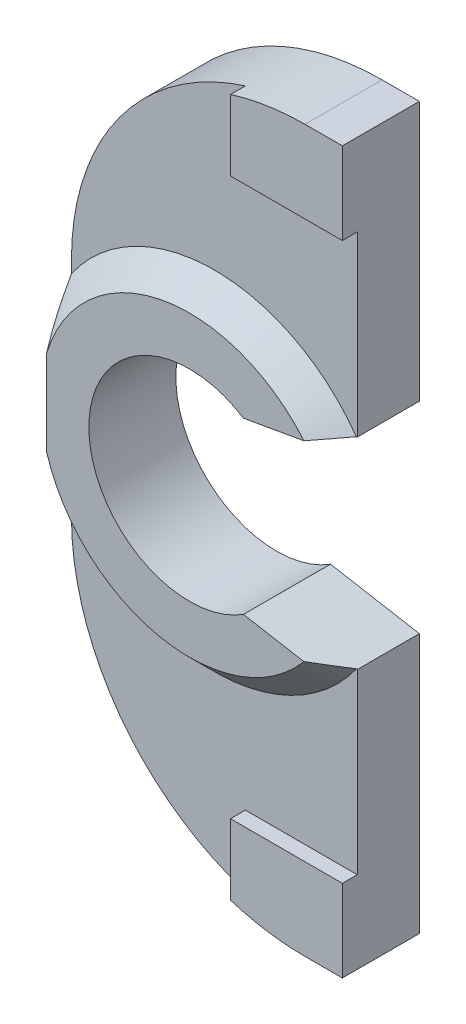
ISO-10303-21;
HEADER;
FILE_DESCRIPTION(('STEP AP214'),'2;1');
FILE_NAME('part.step','',(''),(''),'','','');
FILE_SCHEMA(('AUTOMOTIVE_DESIGN { 1 0 10303 214 1 1 1 1 }'));
ENDSEC;
DATA;
#1=APPLICATION_CONTEXT('core data for automotive mechanical design processes');
#2=APPLICATION_PROTOCOL_DEFINITION('international standard','automotive_design',2000,#1);
#3=PRODUCT_CONTEXT('',#1,'mechanical');
#4=PRODUCT('Part','Part','',(#3));
#5=PRODUCT_RELATED_PRODUCT_CATEGORY('part','',(#4));
#6=PRODUCT_DEFINITION_FORMATION('','',#4);
#7=PRODUCT_DEFINITION_CONTEXT('part definition',#1,'design');
#8=PRODUCT_DEFINITION('design','',#6,#7);
#9=PRODUCT_DEFINITION_SHAPE('','',#8);
#10=(LENGTH_UNIT() NAMED_UNIT(*) SI_UNIT(.MILLI.,.METRE.));
#11=(NAMED_UNIT(*) PLANE_ANGLE_UNIT() SI_UNIT($,.RADIAN.));
#12=(NAMED_UNIT(*) SI_UNIT($,.STERADIAN.) SOLID_ANGLE_UNIT());
#13=UNCERTAINTY_MEASURE_WITH_UNIT(LENGTH_MEASURE(1.E-05),#10,'distance_accuracy_value','');
#14=(GEOMETRIC_REPRESENTATION_CONTEXT(3) GLOBAL_UNCERTAINTY_ASSIGNED_CONTEXT((#13)) GLOBAL_UNIT_ASSIGNED_CONTEXT((#10,
#11,#12)) REPRESENTATION_CONTEXT('',''));
#15=CARTESIAN_POINT('',(0.,0.,0.));
#16=DIRECTION('',(0.,0.,1.));
#17=DIRECTION('',(1.,0.,0.));
#18=AXIS2_PLACEMENT_3D('',#15,#16,#17);
#19=CARTESIAN_POINT('',(0.,0.,2.5));
#20=DIRECTION('',(0.,0.,1.));
#21=DIRECTION('',(1.,0.,0.));
#22=AXIS2_PLACEMENT_3D('',#19,#20,#21);
#23=PLANE('',#22);
#24=DIRECTION('',(-0.984807753012209,0.173648177666924,0.));
#25=VECTOR('',#24,1.);
#26=CARTESIAN_POINT('',(5.75,-4.05,2.5));
#27=LINE('',#26,#25);
#28=CARTESIAN_POINT('',(5.75,-4.05,2.5));
#29=VERTEX_POINT('',#28);
#30=CARTESIAN_POINT('',(5.71392847742438,-4.04363961733469,2.5));
#31=VERTEX_POINT('',#30);
#32=EDGE_CURVE('E268',#29,#31,#27,.T.);
#33=ORIENTED_EDGE('',*,*,#32,.T.);
#34=CARTESIAN_POINT('',(0.,0.,2.5));
#35=DIRECTION('',(0.,0.,1.));
#36=DIRECTION('',(1.,0.,0.));
#37=AXIS2_PLACEMENT_3D('',#34,#35,#36);
#38=CIRCLE('',#37,6.99999999999999);
#39=CARTESIAN_POINT('',(-5.75,-3.99217985566781,2.5));
#40=VERTEX_POINT('',#39);
#41=EDGE_CURVE('E339',#31,#40,#38,.F.);
#42=ORIENTED_EDGE('',*,*,#41,.T.);
#43=DIRECTION('',(0.,-1.,0.));
#44=VECTOR('',#43,1.);
#45=CARTESIAN_POINT('',(-5.75,-4.49999999999993,2.5));
#46=LINE('',#45,#44);
#47=CARTESIAN_POINT('',(-5.75,-4.49999999999993,2.5));
#48=VERTEX_POINT('',#47);
#49=EDGE_CURVE('E285',#40,#48,#46,.T.);
#50=ORIENTED_EDGE('',*,*,#49,.T.);
#51=CARTESIAN_POINT('',(4.25,-4.5,2.5));
#52=DIRECTION('',(0.,0.,1.));
#53=DIRECTION('',(-1.,0.,0.));
#54=AXIS2_PLACEMENT_3D('',#51,#52,#53);
#55=CIRCLE('',#54,10.);
#56=CARTESIAN_POINT('',(1.25,-14.0393920141695,2.5));
#57=VERTEX_POINT('',#56);
#58=EDGE_CURVE('E284',#48,#57,#55,.T.);
#59=ORIENTED_EDGE('',*,*,#58,.T.);
#60=DIRECTION('',(0.,-1.,0.));
#61=VECTOR('',#60,1.);
#62=CARTESIAN_POINT('',(1.25,0.,2.5));
#63=LINE('',#62,#61);
#64=CARTESIAN_POINT('',(1.25,-11.2,2.5));
#65=VERTEX_POINT('',#64);
#66=EDGE_CURVE('E197',#65,#57,#63,.T.);
#67=ORIENTED_EDGE('',*,*,#66,.F.);
#68=DIRECTION('',(-1.,0.,0.));
#69=VECTOR('',#68,1.);
#70=CARTESIAN_POINT('',(0.,-11.2,2.5));
#71=LINE('',#70,#69);
#72=CARTESIAN_POINT('',(5.75,-11.2,2.5));
#73=VERTEX_POINT('',#72);
#74=EDGE_CURVE('E191',#73,#65,#71,.T.);
#75=ORIENTED_EDGE('',*,*,#74,.F.);
#76=DIRECTION('',(0.,1.,0.));
#77=VECTOR('',#76,1.);
#78=CARTESIAN_POINT('',(5.75,-14.5,2.5));
#79=LINE('',#78,#77);
#80=EDGE_CURVE('E266',#73,#29,#79,.T.);
#81=ORIENTED_EDGE('',*,*,#80,.T.);
#82=EDGE_LOOP('',(#33,#42,#50,#59,#67,#75,#81));
#83=FACE_BOUND('',#82,.T.);
#84=ADVANCED_FACE('F37',(#83),#23,.T.);
#85=CARTESIAN_POINT('',(-5.75,4.49999999999993,2.5));
#86=VERTEX_POINT('',#85);
#87=CARTESIAN_POINT('',(-5.75,3.99217985566781,2.5));
#88=VERTEX_POINT('',#87);
#89=EDGE_CURVE('E281',#86,#88,#46,.T.);
#90=ORIENTED_EDGE('',*,*,#89,.T.);
#91=CARTESIAN_POINT('',(0.,0.,2.5));
#92=DIRECTION('',(0.,0.,1.));
#93=DIRECTION('',(1.,0.,0.));
#94=AXIS2_PLACEMENT_3D('',#91,#92,#93);
#95=CIRCLE('',#94,6.99999999999999);
#96=CARTESIAN_POINT('',(5.71392847742438,4.04363961733468,2.5));
#97=VERTEX_POINT('',#96);
#98=EDGE_CURVE('E57',#88,#97,#95,.F.);
#99=ORIENTED_EDGE('',*,*,#98,.T.);
#100=DIRECTION('',(0.984807753012209,0.173648177666923,0.));
#101=VECTOR('',#100,1.);
#102=CARTESIAN_POINT('',(5.75,4.05,2.5));
#103=LINE('',#102,#101);
#104=CARTESIAN_POINT('',(5.75,4.05,2.5));
#105=VERTEX_POINT('',#104);
#106=EDGE_CURVE('E278',#97,#105,#103,.T.);
#107=ORIENTED_EDGE('',*,*,#106,.T.);
#108=DIRECTION('',(0.,1.,0.));
#109=VECTOR('',#108,1.);
#110=CARTESIAN_POINT('',(5.75,4.05,2.5));
#111=LINE('',#110,#109);
#112=CARTESIAN_POINT('',(5.75,11.2,2.5));
#113=VERTEX_POINT('',#112);
#114=EDGE_CURVE('E349',#105,#113,#111,.T.);
#115=ORIENTED_EDGE('',*,*,#114,.T.);
#116=DIRECTION('',(-1.,0.,0.));
#117=VECTOR('',#116,1.);
#118=CARTESIAN_POINT('',(0.,11.2,2.5));
#119=LINE('',#118,#117);
#120=CARTESIAN_POINT('',(1.25,11.2,2.5));
#121=VERTEX_POINT('',#120);
#122=EDGE_CURVE('E224',#113,#121,#119,.T.);
#123=ORIENTED_EDGE('',*,*,#122,.T.);
#124=DIRECTION('',(0.,1.,0.));
#125=VECTOR('',#124,1.);
#126=CARTESIAN_POINT('',(1.25,0.,2.5));
#127=LINE('',#126,#125);
#128=CARTESIAN_POINT('',(1.25,14.0393920141695,2.5));
#129=VERTEX_POINT('',#128);
#130=EDGE_CURVE('E201',#121,#129,#127,.T.);
#131=ORIENTED_EDGE('',*,*,#130,.T.);
#132=CARTESIAN_POINT('',(4.25,4.5,2.5));
#133=DIRECTION('',(0.,0.,1.));
#134=DIRECTION('',(-1.,0.,0.));
#135=AXIS2_PLACEMENT_3D('',#132,#133,#134);
#136=CIRCLE('',#135,10.);
#137=EDGE_CURVE('E290',#129,#86,#136,.T.);
#138=ORIENTED_EDGE('',*,*,#137,.T.);
#139=EDGE_LOOP('',(#90,#99,#107,#115,#123,#131,#138));
#140=FACE_BOUND('',#139,.T.);
#141=ADVANCED_FACE('F372',(#140),#23,.T.);
#142=CARTESIAN_POINT('',(5.75,-14.5,2.5));
#143=DIRECTION('',(-1.,0.,0.));
#144=DIRECTION('',(0.,0.,1.));
#145=AXIS2_PLACEMENT_3D('',#142,#143,#144);
#146=PLANE('',#145);
#147=DIRECTION('',(0.,1.,0.));
#148=VECTOR('',#147,1.);
#149=CARTESIAN_POINT('',(5.75,-14.5,0.));
#150=LINE('',#149,#148);
#151=CARTESIAN_POINT('',(5.75,-14.5,0.));
#152=VERTEX_POINT('',#151);
#153=CARTESIAN_POINT('',(5.75,-4.05,0.));
#154=VERTEX_POINT('',#153);
#155=EDGE_CURVE('E265',#152,#154,#150,.T.);
#156=ORIENTED_EDGE('',*,*,#155,.T.);
#157=DIRECTION('',(0.,0.,-1.));
#158=VECTOR('',#157,1.);
#159=CARTESIAN_POINT('',(5.75,-4.05,2.5));
#160=LINE('',#159,#158);
#161=EDGE_CURVE('E279',#29,#154,#160,.T.);
#162=ORIENTED_EDGE('',*,*,#161,.F.);
#163=ORIENTED_EDGE('',*,*,#80,.F.);
#164=DIRECTION('',(0.,0.,-1.));
#165=VECTOR('',#164,1.);
#166=CARTESIAN_POINT('',(5.75,-11.2,3.1));
#167=LINE('',#166,#165);
#168=CARTESIAN_POINT('',(5.75,-11.2,3.1));
#169=VERTEX_POINT('',#168);
#170=EDGE_CURVE('E202',#169,#73,#167,.T.);
#171=ORIENTED_EDGE('',*,*,#170,.F.);
#172=DIRECTION('',(0.,-1.,0.));
#173=VECTOR('',#172,1.);
#174=CARTESIAN_POINT('',(5.75,0.,3.1));
#175=LINE('',#174,#173);
#176=CARTESIAN_POINT('',(5.75,-14.5,3.1));
#177=VERTEX_POINT('',#176);
#178=EDGE_CURVE('E209',#169,#177,#175,.T.);
#179=ORIENTED_EDGE('',*,*,#178,.T.);
#180=DIRECTION('',(0.,0.,-1.));
#181=VECTOR('',#180,1.);
#182=CARTESIAN_POINT('',(5.75,-14.5,2.5));
#183=LINE('',#182,#181);
#184=EDGE_CURVE('E293',#177,#152,#183,.T.);
#185=ORIENTED_EDGE('',*,*,#184,.T.);
#186=EDGE_LOOP('',(#156,#162,#163,#171,#179,#185));
#187=FACE_BOUND('',#186,.T.);
#188=ADVANCED_FACE('F369',(#187),#146,.F.);
#189=CARTESIAN_POINT('',(5.75,-4.05,2.5));
#190=DIRECTION('',(-0.173648177666924,-0.984807753012209,0.));
#191=DIRECTION('',(0.984807753012209,-0.173648177666924,0.));
#192=AXIS2_PLACEMENT_3D('',#189,#190,#191);
#193=PLANE('',#192);
#194=DIRECTION('',(-0.984807753012209,0.173648177666924,0.));
#195=VECTOR('',#194,1.);
#196=CARTESIAN_POINT('',(5.75,-4.05,0.));
#197=LINE('',#196,#195);
#198=CARTESIAN_POINT('',(2.1710370982712,-3.41893227747058,0.));
#199=VERTEX_POINT('',#198);
#200=EDGE_CURVE('E296',#154,#199,#197,.T.);
#201=ORIENTED_EDGE('',*,*,#200,.T.);
#202=DIRECTION('',(0.,0.,-1.));
#203=VECTOR('',#202,1.);
#204=CARTESIAN_POINT('',(2.1710370982712,-3.41893227747058,2.5));
#205=LINE('',#204,#203);
#206=CARTESIAN_POINT('',(2.1710370982712,-3.41893227747058,3.5));
#207=VERTEX_POINT('',#206);
#208=EDGE_CURVE('E333',#207,#199,#205,.T.);
#209=ORIENTED_EDGE('',*,*,#208,.F.);
#210=DIRECTION('',(-0.984807753012209,0.173648177666924,0.));
#211=VECTOR('',#210,1.);
#212=CARTESIAN_POINT('',(-0.519207074993954,-2.94456964503021,3.5));
#213=LINE('',#212,#211);
#214=CARTESIAN_POINT('',(4.60368046815133,-3.84787293802199,3.5));
#215=VERTEX_POINT('',#214);
#216=EDGE_CURVE('E253',#215,#207,#213,.T.);
#217=ORIENTED_EDGE('',*,*,#216,.F.);
#218=CARTESIAN_POINT('',(4.60368046815133,-3.84787293802199,3.5));
#219=CARTESIAN_POINT('',(4.69712587753436,-3.86434988491957,3.41773028763104));
#220=CARTESIAN_POINT('',(4.79030234890888,-3.8807794107901,3.33514654572433));
#221=CARTESIAN_POINT('',(4.97617369042814,-3.91355354324043,3.16942707423543));
#222=CARTESIAN_POINT('',(5.0688685734413,-3.92989815208926,3.08629135953899));
#223=CARTESIAN_POINT('',(5.25383748566177,-3.96251316190602,2.9195400740654));
#224=CARTESIAN_POINT('',(5.34611151732714,-3.97878356330738,2.83592450609737));
#225=CARTESIAN_POINT('',(5.53028787525767,-4.01125882441915,2.66826721503222));
#226=CARTESIAN_POINT('',(5.62219019148347,-4.02746368235936,2.58422548056146));
#227=CARTESIAN_POINT('',(5.71392847742438,-4.04363961733469,2.5));
#228=B_SPLINE_CURVE_WITH_KNOTS('',3,(#218,#219,#220,#221,#222,#223,#224,#225,#226,#227),
.UNSPECIFIED.,.F.,.F.,(4,2,2,2,4),(0.,0.376756384107006,0.753502648679371,1.13024670997776,
1.50700087940601),.UNSPECIFIED.);
#229=EDGE_CURVE('E346',#215,#31,#228,.T.);
#230=ORIENTED_EDGE('',*,*,#229,.T.);
#231=ORIENTED_EDGE('',*,*,#32,.F.);
#232=ORIENTED_EDGE('',*,*,#161,.T.);
#233=EDGE_LOOP('',(#201,#209,#217,#230,#231,#232));
#234=FACE_BOUND('',#233,.T.);
#235=ADVANCED_FACE('F361',(#234),#193,.F.);
#236=CARTESIAN_POINT('',(0.,0.,2.5));
#237=DIRECTION('',(0.,0.,-1.));
#238=DIRECTION('',(-1.,0.,0.));
#239=AXIS2_PLACEMENT_3D('',#236,#237,#238);
#240=CYLINDRICAL_SURFACE('',#239,4.05);
#241=CARTESIAN_POINT('',(0.,0.,0.));
#242=DIRECTION('',(0.,0.,-1.));
#243=DIRECTION('',(1.,0.,0.));
#244=AXIS2_PLACEMENT_3D('',#241,#242,#243);
#245=CIRCLE('',#244,4.05);
#246=CARTESIAN_POINT('',(2.1710370982712,3.41893227747058,0.));
#247=VERTEX_POINT('',#246);
#248=EDGE_CURVE('E298',#199,#247,#245,.T.);
#249=ORIENTED_EDGE('',*,*,#248,.T.);
#250=DIRECTION('',(0.,0.,-1.));
#251=VECTOR('',#250,1.);
#252=CARTESIAN_POINT('',(2.1710370982712,3.41893227747058,2.5));
#253=LINE('',#252,#251);
#254=CARTESIAN_POINT('',(2.1710370982712,3.41893227747058,3.5));
#255=VERTEX_POINT('',#254);
#256=EDGE_CURVE('E331',#255,#247,#253,.T.);
#257=ORIENTED_EDGE('',*,*,#256,.F.);
#258=CARTESIAN_POINT('',(0.,0.,3.5));
#259=DIRECTION('',(0.,0.,1.));
#260=DIRECTION('',(1.,0.,0.));
#261=AXIS2_PLACEMENT_3D('',#258,#259,#260);
#262=CIRCLE('',#261,4.05);
#263=EDGE_CURVE('E256',#207,#255,#262,.F.);
#264=ORIENTED_EDGE('',*,*,#263,.F.);
#265=ORIENTED_EDGE('',*,*,#208,.T.);
#266=EDGE_LOOP('',(#249,#257,#264,#265));
#267=FACE_BOUND('',#266,.T.);
#268=ADVANCED_FACE('F378',(#267),#240,.F.);
#269=CARTESIAN_POINT('',(5.75,4.05,2.5));
#270=DIRECTION('',(-0.173648177666923,0.984807753012209,0.));
#271=DIRECTION('',(-0.98480775301221,-0.173648177666923,0.));
#272=AXIS2_PLACEMENT_3D('',#269,#270,#271);
#273=PLANE('',#272);
#274=DIRECTION('',(0.984807753012209,0.173648177666923,0.));
#275=VECTOR('',#274,1.);
#276=CARTESIAN_POINT('',(5.75,4.05,0.));
#277=LINE('',#276,#275);
#278=CARTESIAN_POINT('',(5.75,4.05,0.));
#279=VERTEX_POINT('',#278);
#280=EDGE_CURVE('E300',#247,#279,#277,.T.);
#281=ORIENTED_EDGE('',*,*,#280,.T.);
#282=DIRECTION('',(0.,0.,-1.));
#283=VECTOR('',#282,1.);
#284=CARTESIAN_POINT('',(5.75,4.05,2.5));
#285=LINE('',#284,#283);
#286=EDGE_CURVE('E328',#105,#279,#285,.T.);
#287=ORIENTED_EDGE('',*,*,#286,.F.);
#288=ORIENTED_EDGE('',*,*,#106,.F.);
#289=CARTESIAN_POINT('',(5.71392847742438,4.04363961733468,2.5));
#290=CARTESIAN_POINT('',(5.62219019148347,4.02746368235935,2.58422548056145));
#291=CARTESIAN_POINT('',(5.53028787525767,4.01125882441914,2.66826721503222));
#292=CARTESIAN_POINT('',(5.34611151732714,3.97878356330737,2.83592450609737));
#293=CARTESIAN_POINT('',(5.25383748566177,3.96251316190602,2.9195400740654));
#294=CARTESIAN_POINT('',(5.0688685734413,3.92989815208926,3.08629135953899));
#295=CARTESIAN_POINT('',(4.97617369042814,3.91355354324042,3.16942707423543));
#296=CARTESIAN_POINT('',(4.79030234890888,3.8807794107901,3.33514654572433));
#297=CARTESIAN_POINT('',(4.69712587753436,3.86434988491956,3.41773028763105));
#298=CARTESIAN_POINT('',(4.60368046815134,3.84787293802199,3.50000000000001));
#299=B_SPLINE_CURVE_WITH_KNOTS('',3,(#289,#290,#291,#292,#293,#294,#295,#296,#297,#298),
.UNSPECIFIED.,.F.,.F.,(4,2,2,2,4),(0.,0.376754169428249,0.75349823072664,1.130244495299,
1.50700087940601),.UNSPECIFIED.);
#300=CARTESIAN_POINT('',(4.60368046815133,3.84787293802199,3.5));
#301=VERTEX_POINT('',#300);
#302=EDGE_CURVE('E11',#97,#301,#299,.T.);
#303=ORIENTED_EDGE('',*,*,#302,.T.);
#304=DIRECTION('',(0.984807753012209,0.173648177666923,0.));
#305=VECTOR('',#304,1.);
#306=CARTESIAN_POINT('',(-0.519207074993951,2.94456964503021,3.5));
#307=LINE('',#306,#305);
#308=EDGE_CURVE('E259',#255,#301,#307,.T.);
#309=ORIENTED_EDGE('',*,*,#308,.F.);
#310=ORIENTED_EDGE('',*,*,#256,.T.);
#311=EDGE_LOOP('',(#281,#287,#288,#303,#309,#310));
#312=FACE_BOUND('',#311,.T.);
#313=ADVANCED_FACE('F420',(#312),#273,.F.);
#314=CARTESIAN_POINT('',(5.75,4.05,2.5));
#315=DIRECTION('',(-1.,0.,0.));
#316=DIRECTION('',(0.,0.,1.));
#317=AXIS2_PLACEMENT_3D('',#314,#315,#316);
#318=PLANE('',#317);
#319=DIRECTION('',(0.,1.,0.));
#320=VECTOR('',#319,1.);
#321=CARTESIAN_POINT('',(5.75,4.05,0.));
#322=LINE('',#321,#320);
#323=CARTESIAN_POINT('',(5.75,14.5,0.));
#324=VERTEX_POINT('',#323);
#325=EDGE_CURVE('E302',#279,#324,#322,.T.);
#326=ORIENTED_EDGE('',*,*,#325,.T.);
#327=DIRECTION('',(0.,0.,-1.));
#328=VECTOR('',#327,1.);
#329=CARTESIAN_POINT('',(5.75,14.5,2.5));
#330=LINE('',#329,#328);
#331=CARTESIAN_POINT('',(5.75,14.5,3.1));
#332=VERTEX_POINT('',#331);
#333=EDGE_CURVE('E325',#332,#324,#330,.T.);
#334=ORIENTED_EDGE('',*,*,#333,.F.);
#335=DIRECTION('',(0.,1.,0.));
#336=VECTOR('',#335,1.);
#337=CARTESIAN_POINT('',(5.75,0.,3.1));
#338=LINE('',#337,#336);
#339=CARTESIAN_POINT('',(5.75,11.2,3.1));
#340=VERTEX_POINT('',#339);
#341=EDGE_CURVE('E227',#340,#332,#338,.T.);
#342=ORIENTED_EDGE('',*,*,#341,.F.);
#343=DIRECTION('',(0.,0.,-1.));
#344=VECTOR('',#343,1.);
#345=CARTESIAN_POINT('',(5.75,11.2,3.1));
#346=LINE('',#345,#344);
#347=EDGE_CURVE('E241',#340,#113,#346,.T.);
#348=ORIENTED_EDGE('',*,*,#347,.T.);
#349=ORIENTED_EDGE('',*,*,#114,.F.);
#350=ORIENTED_EDGE('',*,*,#286,.T.);
#351=EDGE_LOOP('',(#326,#334,#342,#348,#349,#350));
#352=FACE_BOUND('',#351,.T.);
#353=ADVANCED_FACE('F426',(#352),#318,.F.);
#354=CARTESIAN_POINT('',(5.75,14.5,2.5));
#355=DIRECTION('',(0.,-1.,0.));
#356=DIRECTION('',(0.,0.,-1.));
#357=AXIS2_PLACEMENT_3D('',#354,#355,#356);
#358=PLANE('',#357);
#359=DIRECTION('',(-1.,0.,0.));
#360=VECTOR('',#359,1.);
#361=CARTESIAN_POINT('',(5.75,14.5,0.));
#362=LINE('',#361,#360);
#363=CARTESIAN_POINT('',(4.25000000000007,14.5,0.));
#364=VERTEX_POINT('',#363);
#365=EDGE_CURVE('E304',#324,#364,#362,.T.);
#366=ORIENTED_EDGE('',*,*,#365,.T.);
#367=DIRECTION('',(0.,0.,-1.));
#368=VECTOR('',#367,1.);
#369=CARTESIAN_POINT('',(4.25000000000007,14.5,2.5));
#370=LINE('',#369,#368);
#371=CARTESIAN_POINT('',(4.25000000000007,14.5,3.1));
#372=VERTEX_POINT('',#371);
#373=EDGE_CURVE('E322',#372,#364,#370,.T.);
#374=ORIENTED_EDGE('',*,*,#373,.F.);
#375=DIRECTION('',(-1.,0.,0.));
#376=VECTOR('',#375,1.);
#377=CARTESIAN_POINT('',(0.,14.5,3.1));
#378=LINE('',#377,#376);
#379=EDGE_CURVE('E230',#332,#372,#378,.T.);
#380=ORIENTED_EDGE('',*,*,#379,.F.);
#381=ORIENTED_EDGE('',*,*,#333,.T.);
#382=EDGE_LOOP('',(#366,#374,#380,#381));
#383=FACE_BOUND('',#382,.T.);
#384=ADVANCED_FACE('F431',(#383),#358,.F.);
#385=CARTESIAN_POINT('',(4.25,4.5,2.5));
#386=DIRECTION('',(0.,0.,-1.));
#387=DIRECTION('',(-1.,0.,0.));
#388=AXIS2_PLACEMENT_3D('',#385,#386,#387);
#389=CYLINDRICAL_SURFACE('',#388,10.);
#390=CARTESIAN_POINT('',(4.25,4.5,0.));
#391=DIRECTION('',(0.,0.,1.));
#392=DIRECTION('',(-1.,0.,0.));
#393=AXIS2_PLACEMENT_3D('',#390,#391,#392);
#394=CIRCLE('',#393,10.);
#395=CARTESIAN_POINT('',(-5.75,4.49999999999993,0.));
#396=VERTEX_POINT('',#395);
#397=EDGE_CURVE('E306',#364,#396,#394,.T.);
#398=ORIENTED_EDGE('',*,*,#397,.T.);
#399=DIRECTION('',(0.,0.,-1.));
#400=VECTOR('',#399,1.);
#401=CARTESIAN_POINT('',(-5.75,4.49999999999993,2.5));
#402=LINE('',#401,#400);
#403=EDGE_CURVE('E319',#86,#396,#402,.T.);
#404=ORIENTED_EDGE('',*,*,#403,.F.);
#405=ORIENTED_EDGE('',*,*,#137,.F.);
#406=DIRECTION('',(0.,0.,-1.));
#407=VECTOR('',#406,1.);
#408=CARTESIAN_POINT('',(1.25,14.0393920141695,3.1));
#409=LINE('',#408,#407);
#410=CARTESIAN_POINT('',(1.25,14.0393920141695,3.1));
#411=VERTEX_POINT('',#410);
#412=EDGE_CURVE('E235',#411,#129,#409,.T.);
#413=ORIENTED_EDGE('',*,*,#412,.F.);
#414=CARTESIAN_POINT('',(4.25,4.5,3.1));
#415=DIRECTION('',(0.,0.,1.));
#416=DIRECTION('',(1.,0.,0.));
#417=AXIS2_PLACEMENT_3D('',#414,#415,#416);
#418=CIRCLE('',#417,10.);
#419=EDGE_CURVE('E233',#372,#411,#418,.T.);
#420=ORIENTED_EDGE('',*,*,#419,.F.);
#421=ORIENTED_EDGE('',*,*,#373,.T.);
#422=EDGE_LOOP('',(#398,#404,#405,#413,#420,#421));
#423=FACE_BOUND('',#422,.T.);
#424=ADVANCED_FACE('F400',(#423),#389,.T.);
#425=CARTESIAN_POINT('',(-5.75,-4.49999999999993,2.5));
#426=DIRECTION('',(1.,0.,0.));
#427=DIRECTION('',(0.,0.,-1.));
#428=AXIS2_PLACEMENT_3D('',#425,#426,#427);
#429=PLANE('',#428);
#430=DIRECTION('',(0.,-1.,0.));
#431=VECTOR('',#430,1.);
#432=CARTESIAN_POINT('',(-5.75,-4.49999999999993,0.));
#433=LINE('',#432,#431);
#434=CARTESIAN_POINT('',(-5.75,-4.49999999999993,0.));
#435=VERTEX_POINT('',#434);
#436=EDGE_CURVE('E308',#396,#435,#433,.T.);
#437=ORIENTED_EDGE('',*,*,#436,.T.);
#438=DIRECTION('',(0.,0.,-1.));
#439=VECTOR('',#438,1.);
#440=CARTESIAN_POINT('',(-5.75,-4.49999999999993,2.5));
#441=LINE('',#440,#439);
#442=EDGE_CURVE('E316',#48,#435,#441,.T.);
#443=ORIENTED_EDGE('',*,*,#442,.F.);
#444=ORIENTED_EDGE('',*,*,#49,.F.);
#445=CARTESIAN_POINT('',(-5.75,-3.99217985566781,2.5));
#446=CARTESIAN_POINT('',(-5.75,-3.90180240769152,2.55153953865916));
#447=CARTESIAN_POINT('',(-5.75,-3.8109196800283,2.60219407376041));
#448=CARTESIAN_POINT('',(-5.75,-3.62805900191775,2.70151431766857));
#449=CARTESIAN_POINT('',(-5.75,-3.53608090547775,2.75017975744617));
#450=CARTESIAN_POINT('',(-5.75,-3.25909191578406,2.892494903162));
#451=CARTESIAN_POINT('',(-5.75,-3.07236459984431,2.9828446342258));
#452=CARTESIAN_POINT('',(-5.75,-2.69371263023023,3.1525665038618));
#453=CARTESIAN_POINT('',(-5.75,-2.50178348024446,3.23192875824658));
#454=CARTESIAN_POINT('',(-5.75,-2.11209800499191,3.37703001038166));
#455=CARTESIAN_POINT('',(-5.75,-1.91432336908472,3.4427195088457));
#456=CARTESIAN_POINT('',(-5.75,-1.71391365010027,3.5));
#457=B_SPLINE_CURVE_WITH_KNOTS('',3,(#445,#446,#447,#448,#449,#450,#451,#452,#453,#454,#455,
#456),.UNSPECIFIED.,.F.,.F.,(4,2,2,2,2,4),(0.,0.312114460192861,0.624270995766412,
1.24629527751471,1.86887553778871,2.49367195066354),.UNSPECIFIED.);
#458=CARTESIAN_POINT('',(-5.75,-1.71391365010027,3.5));
#459=VERTEX_POINT('',#458);
#460=EDGE_CURVE('E356',#40,#459,#457,.T.);
#461=ORIENTED_EDGE('',*,*,#460,.T.);
#462=DIRECTION('',(0.,-1.,0.));
#463=VECTOR('',#462,1.);
#464=CARTESIAN_POINT('',(-5.75,0.,3.5));
#465=LINE('',#464,#463);
#466=CARTESIAN_POINT('',(-5.75,1.71391365010027,3.5));
#467=VERTEX_POINT('',#466);
#468=EDGE_CURVE('E247',#467,#459,#465,.T.);
#469=ORIENTED_EDGE('',*,*,#468,.F.);
#470=CARTESIAN_POINT('',(-5.75,1.71391365010027,3.5));
#471=CARTESIAN_POINT('',(-5.75,1.91432336908472,3.4427195088457));
#472=CARTESIAN_POINT('',(-5.75,2.11209800499191,3.37703001038166));
#473=CARTESIAN_POINT('',(-5.75,2.50178348024446,3.23192875824658));
#474=CARTESIAN_POINT('',(-5.75,2.69371263023022,3.1525665038618));
#475=CARTESIAN_POINT('',(-5.75,3.07236459984431,2.9828446342258));
#476=CARTESIAN_POINT('',(-5.75,3.25909191578405,2.89249490316201));
#477=CARTESIAN_POINT('',(-5.75,3.53608090547775,2.75017975744617));
#478=CARTESIAN_POINT('',(-5.75,3.62805900191774,2.70151431766857));
#479=CARTESIAN_POINT('',(-5.75,3.8109196800283,2.60219407376041));
#480=CARTESIAN_POINT('',(-5.75,3.90180240769152,2.55153953865916));
#481=CARTESIAN_POINT('',(-5.75,3.99217985566781,2.5));
#482=B_SPLINE_CURVE_WITH_KNOTS('',3,(#470,#471,#472,#473,#474,#475,#476,#477,#478,#479,#480,
#481),.UNSPECIFIED.,.F.,.F.,(4,2,2,2,2,4),(0.,0.624796412874831,1.24737667314883,
1.86940095489713,2.18155749047067,2.49367195066353),.UNSPECIFIED.);
#483=EDGE_CURVE('E50',#467,#88,#482,.T.);
#484=ORIENTED_EDGE('',*,*,#483,.T.);
#485=ORIENTED_EDGE('',*,*,#89,.F.);
#486=ORIENTED_EDGE('',*,*,#403,.T.);
#487=EDGE_LOOP('',(#437,#443,#444,#461,#469,#484,#485,#486));
#488=FACE_BOUND('',#487,.T.);
#489=ADVANCED_FACE('F396',(#488),#429,.F.);
#490=CARTESIAN_POINT('',(4.25,-4.5,2.5));
#491=DIRECTION('',(0.,0.,-1.));
#492=DIRECTION('',(-1.,0.,0.));
#493=AXIS2_PLACEMENT_3D('',#490,#491,#492);
#494=CYLINDRICAL_SURFACE('',#493,10.);
#495=CARTESIAN_POINT('',(4.25,-4.5,0.));
#496=DIRECTION('',(0.,0.,1.));
#497=DIRECTION('',(-1.,0.,0.));
#498=AXIS2_PLACEMENT_3D('',#495,#496,#497);
#499=CIRCLE('',#498,10.);
#500=CARTESIAN_POINT('',(4.25000000000007,-14.5,0.));
#501=VERTEX_POINT('',#500);
#502=EDGE_CURVE('E310',#435,#501,#499,.T.);
#503=ORIENTED_EDGE('',*,*,#502,.T.);
#504=DIRECTION('',(0.,0.,-1.));
#505=VECTOR('',#504,1.);
#506=CARTESIAN_POINT('',(4.25000000000007,-14.5,2.5));
#507=LINE('',#506,#505);
#508=CARTESIAN_POINT('',(4.25000000000007,-14.5,3.1));
#509=VERTEX_POINT('',#508);
#510=EDGE_CURVE('E206',#509,#501,#507,.T.);
#511=ORIENTED_EDGE('',*,*,#510,.F.);
#512=CARTESIAN_POINT('',(4.25,-4.5,3.1));
#513=DIRECTION('',(0.,0.,-1.));
#514=DIRECTION('',(1.,0.,0.));
#515=AXIS2_PLACEMENT_3D('',#512,#513,#514);
#516=CIRCLE('',#515,10.);
#517=CARTESIAN_POINT('',(1.25,-14.0393920141695,3.1));
#518=VERTEX_POINT('',#517);
#519=EDGE_CURVE('E183',#509,#518,#516,.T.);
#520=ORIENTED_EDGE('',*,*,#519,.T.);
#521=DIRECTION('',(0.,0.,-1.));
#522=VECTOR('',#521,1.);
#523=CARTESIAN_POINT('',(1.25,-14.0393920141695,3.1));
#524=LINE('',#523,#522);
#525=EDGE_CURVE('E194',#518,#57,#524,.T.);
#526=ORIENTED_EDGE('',*,*,#525,.T.);
#527=ORIENTED_EDGE('',*,*,#58,.F.);
#528=ORIENTED_EDGE('',*,*,#442,.T.);
#529=EDGE_LOOP('',(#503,#511,#520,#526,#527,#528));
#530=FACE_BOUND('',#529,.T.);
#531=ADVANCED_FACE('F204',(#530),#494,.T.);
#532=CARTESIAN_POINT('',(5.75,-14.5,2.5));
#533=DIRECTION('',(0.,1.,0.));
#534=DIRECTION('',(0.,0.,1.));
#535=AXIS2_PLACEMENT_3D('',#532,#533,#534);
#536=PLANE('',#535);
#537=DIRECTION('',(1.,0.,0.));
#538=VECTOR('',#537,1.);
#539=CARTESIAN_POINT('',(5.75,-14.5,0.));
#540=LINE('',#539,#538);
#541=EDGE_CURVE('E269',#501,#152,#540,.T.);
#542=ORIENTED_EDGE('',*,*,#541,.T.);
#543=ORIENTED_EDGE('',*,*,#184,.F.);
#544=DIRECTION('',(-1.,0.,0.));
#545=VECTOR('',#544,1.);
#546=CARTESIAN_POINT('',(0.,-14.5,3.1));
#547=LINE('',#546,#545);
#548=EDGE_CURVE('E207',#177,#509,#547,.T.);
#549=ORIENTED_EDGE('',*,*,#548,.T.);
#550=ORIENTED_EDGE('',*,*,#510,.T.);
#551=EDGE_LOOP('',(#542,#543,#549,#550));
#552=FACE_BOUND('',#551,.T.);
#553=ADVANCED_FACE('F390',(#552),#536,.F.);
#554=CARTESIAN_POINT('',(0.,0.,0.));
#555=DIRECTION('',(0.,0.,1.));
#556=DIRECTION('',(1.,0.,0.));
#557=AXIS2_PLACEMENT_3D('',#554,#555,#556);
#558=PLANE('',#557);
#559=ORIENTED_EDGE('',*,*,#155,.F.);
#560=ORIENTED_EDGE('',*,*,#541,.F.);
#561=ORIENTED_EDGE('',*,*,#502,.F.);
#562=ORIENTED_EDGE('',*,*,#436,.F.);
#563=ORIENTED_EDGE('',*,*,#397,.F.);
#564=ORIENTED_EDGE('',*,*,#365,.F.);
#565=ORIENTED_EDGE('',*,*,#325,.F.);
#566=ORIENTED_EDGE('',*,*,#280,.F.);
#567=ORIENTED_EDGE('',*,*,#248,.F.);
#568=ORIENTED_EDGE('',*,*,#200,.F.);
#569=EDGE_LOOP('',(#559,#560,#561,#562,#563,#564,#565,#566,#567,#568));
#570=FACE_BOUND('',#569,.T.);
#571=ADVANCED_FACE('F387',(#570),#558,.F.);
#572=CARTESIAN_POINT('',(0.,0.,3.5));
#573=DIRECTION('',(0.,0.,1.));
#574=DIRECTION('',(1.,0.,0.));
#575=AXIS2_PLACEMENT_3D('',#572,#573,#574);
#576=PLANE('',#575);
#577=ORIENTED_EDGE('',*,*,#468,.T.);
#578=CARTESIAN_POINT('',(0.,0.,3.5));
#579=DIRECTION('',(0.,0.,1.));
#580=DIRECTION('',(1.,0.,0.));
#581=AXIS2_PLACEMENT_3D('',#578,#579,#580);
#582=CIRCLE('',#581,6.);
#583=EDGE_CURVE('E250',#459,#215,#582,.T.);
#584=ORIENTED_EDGE('',*,*,#583,.T.);
#585=ORIENTED_EDGE('',*,*,#216,.T.);
#586=ORIENTED_EDGE('',*,*,#263,.T.);
#587=ORIENTED_EDGE('',*,*,#308,.T.);
#588=CARTESIAN_POINT('',(0.,0.,3.5));
#589=DIRECTION('',(0.,0.,1.));
#590=DIRECTION('',(1.,0.,0.));
#591=AXIS2_PLACEMENT_3D('',#588,#589,#590);
#592=CIRCLE('',#591,6.);
#593=EDGE_CURVE('E262',#301,#467,#592,.T.);
#594=ORIENTED_EDGE('',*,*,#593,.T.);
#595=EDGE_LOOP('',(#577,#584,#585,#586,#587,#594));
#596=FACE_BOUND('',#595,.T.);
#597=ADVANCED_FACE('F385',(#596),#576,.T.);
#598=CARTESIAN_POINT('',(1.25,0.,3.1));
#599=DIRECTION('',(-1.,0.,0.));
#600=DIRECTION('',(0.,0.,1.));
#601=AXIS2_PLACEMENT_3D('',#598,#599,#600);
#602=PLANE('',#601);
#603=ORIENTED_EDGE('',*,*,#130,.F.);
#604=DIRECTION('',(0.,0.,-1.));
#605=VECTOR('',#604,1.);
#606=CARTESIAN_POINT('',(1.25,11.2,3.1));
#607=LINE('',#606,#605);
#608=CARTESIAN_POINT('',(1.25,11.2,3.1));
#609=VERTEX_POINT('',#608);
#610=EDGE_CURVE('E244',#609,#121,#607,.T.);
#611=ORIENTED_EDGE('',*,*,#610,.F.);
#612=DIRECTION('',(0.,1.,0.));
#613=VECTOR('',#612,1.);
#614=CARTESIAN_POINT('',(1.25,0.,3.1));
#615=LINE('',#614,#613);
#616=EDGE_CURVE('E220',#609,#411,#615,.T.);
#617=ORIENTED_EDGE('',*,*,#616,.T.);
#618=ORIENTED_EDGE('',*,*,#412,.T.);
#619=EDGE_LOOP('',(#603,#611,#617,#618));
#620=FACE_BOUND('',#619,.T.);
#621=ADVANCED_FACE('F442',(#620),#602,.T.);
#622=CARTESIAN_POINT('',(0.,11.2,3.1));
#623=DIRECTION('',(0.,-1.,0.));
#624=DIRECTION('',(1.,0.,0.));
#625=AXIS2_PLACEMENT_3D('',#622,#623,#624);
#626=PLANE('',#625);
#627=ORIENTED_EDGE('',*,*,#122,.F.);
#628=ORIENTED_EDGE('',*,*,#347,.F.);
#629=DIRECTION('',(-1.,0.,0.));
#630=VECTOR('',#629,1.);
#631=CARTESIAN_POINT('',(0.,11.2,3.1));
#632=LINE('',#631,#630);
#633=EDGE_CURVE('E223',#340,#609,#632,.T.);
#634=ORIENTED_EDGE('',*,*,#633,.T.);
#635=ORIENTED_EDGE('',*,*,#610,.T.);
#636=EDGE_LOOP('',(#627,#628,#634,#635));
#637=FACE_BOUND('',#636,.T.);
#638=ADVANCED_FACE('F445',(#637),#626,.T.);
#639=CARTESIAN_POINT('',(0.,0.,3.1));
#640=DIRECTION('',(0.,0.,1.));
#641=DIRECTION('',(1.,0.,0.));
#642=AXIS2_PLACEMENT_3D('',#639,#640,#641);
#643=PLANE('',#642);
#644=ORIENTED_EDGE('',*,*,#616,.F.);
#645=ORIENTED_EDGE('',*,*,#633,.F.);
#646=ORIENTED_EDGE('',*,*,#341,.T.);
#647=ORIENTED_EDGE('',*,*,#379,.T.);
#648=ORIENTED_EDGE('',*,*,#419,.T.);
#649=EDGE_LOOP('',(#644,#645,#646,#647,#648));
#650=FACE_BOUND('',#649,.T.);
#651=ADVANCED_FACE('F435',(#650),#643,.T.);
#652=CARTESIAN_POINT('',(1.25,0.,3.1));
#653=DIRECTION('',(1.,0.,0.));
#654=DIRECTION('',(0.,0.,-1.));
#655=AXIS2_PLACEMENT_3D('',#652,#653,#654);
#656=PLANE('',#655);
#657=ORIENTED_EDGE('',*,*,#66,.T.);
#658=ORIENTED_EDGE('',*,*,#525,.F.);
#659=DIRECTION('',(0.,-1.,0.));
#660=VECTOR('',#659,1.);
#661=CARTESIAN_POINT('',(1.25,0.,3.1));
#662=LINE('',#661,#660);
#663=CARTESIAN_POINT('',(1.25,-11.2,3.1));
#664=VERTEX_POINT('',#663);
#665=EDGE_CURVE('E178',#664,#518,#662,.T.);
#666=ORIENTED_EDGE('',*,*,#665,.F.);
#667=DIRECTION('',(0.,0.,-1.));
#668=VECTOR('',#667,1.);
#669=CARTESIAN_POINT('',(1.25,-11.2,3.1));
#670=LINE('',#669,#668);
#671=EDGE_CURVE('E215',#664,#65,#670,.T.);
#672=ORIENTED_EDGE('',*,*,#671,.T.);
#673=EDGE_LOOP('',(#657,#658,#666,#672));
#674=FACE_BOUND('',#673,.T.);
#675=ADVANCED_FACE('F195',(#674),#656,.F.);
#676=CARTESIAN_POINT('',(0.,-11.2,3.1));
#677=DIRECTION('',(0.,-1.,0.));
#678=DIRECTION('',(1.,0.,0.));
#679=AXIS2_PLACEMENT_3D('',#676,#677,#678);
#680=PLANE('',#679);
#681=ORIENTED_EDGE('',*,*,#74,.T.);
#682=ORIENTED_EDGE('',*,*,#671,.F.);
#683=DIRECTION('',(-1.,0.,0.));
#684=VECTOR('',#683,1.);
#685=CARTESIAN_POINT('',(0.,-11.2,3.1));
#686=LINE('',#685,#684);
#687=EDGE_CURVE('E187',#169,#664,#686,.T.);
#688=ORIENTED_EDGE('',*,*,#687,.F.);
#689=ORIENTED_EDGE('',*,*,#170,.T.);
#690=EDGE_LOOP('',(#681,#682,#688,#689));
#691=FACE_BOUND('',#690,.T.);
#692=ADVANCED_FACE('F463',(#691),#680,.F.);
#693=CARTESIAN_POINT('',(0.,0.,3.1));
#694=DIRECTION('',(0.,0.,1.));
#695=DIRECTION('',(1.,0.,0.));
#696=AXIS2_PLACEMENT_3D('',#693,#694,#695);
#697=PLANE('',#696);
#698=ORIENTED_EDGE('',*,*,#665,.T.);
#699=ORIENTED_EDGE('',*,*,#519,.F.);
#700=ORIENTED_EDGE('',*,*,#548,.F.);
#701=ORIENTED_EDGE('',*,*,#178,.F.);
#702=ORIENTED_EDGE('',*,*,#687,.T.);
#703=EDGE_LOOP('',(#698,#699,#700,#701,#702));
#704=FACE_BOUND('',#703,.T.);
#705=ADVANCED_FACE('F180',(#704),#697,.T.);
#706=CARTESIAN_POINT('',(0.,0.,3.5));
#707=DIRECTION('',(0.,0.,-1.));
#708=DIRECTION('',(-1.,0.,0.));
#709=AXIS2_PLACEMENT_3D('',#706,#707,#708);
#710=CONICAL_SURFACE('',#709,6.,0.785398163397443);
#711=ORIENTED_EDGE('',*,*,#460,.F.);
#712=ORIENTED_EDGE('',*,*,#41,.F.);
#713=ORIENTED_EDGE('',*,*,#229,.F.);
#714=ORIENTED_EDGE('',*,*,#583,.F.);
#715=EDGE_LOOP('',(#711,#712,#713,#714));
#716=FACE_BOUND('',#715,.T.);
#717=ADVANCED_FACE('F365',(#716),#710,.T.);
#718=CARTESIAN_POINT('',(0.,0.,3.5));
#719=DIRECTION('',(0.,0.,-1.));
#720=DIRECTION('',(-1.,0.,0.));
#721=AXIS2_PLACEMENT_3D('',#718,#719,#720);
#722=CONICAL_SURFACE('',#721,6.,0.785398163397442);
#723=ORIENTED_EDGE('',*,*,#302,.F.);
#724=ORIENTED_EDGE('',*,*,#98,.F.);
#725=ORIENTED_EDGE('',*,*,#483,.F.);
#726=ORIENTED_EDGE('',*,*,#593,.F.);
#727=EDGE_LOOP('',(#723,#724,#725,#726));
#728=FACE_BOUND('',#727,.T.);
#729=ADVANCED_FACE('F39',(#728),#722,.T.);
#730=CLOSED_SHELL('',(#84,#141,#188,#235,#268,#313,#353,#384,#424,#489,#531,#553,#571,#597,#621,
#638,#651,#675,#692,#705,#717,#729));
#731=MANIFOLD_SOLID_BREP('B2',#730);
#732=ADVANCED_BREP_SHAPE_REPRESENTATION('',(#18,#731),#14);
#733=SHAPE_DEFINITION_REPRESENTATION(#9,#732);
ENDSEC;
END-ISO-10303-21;
